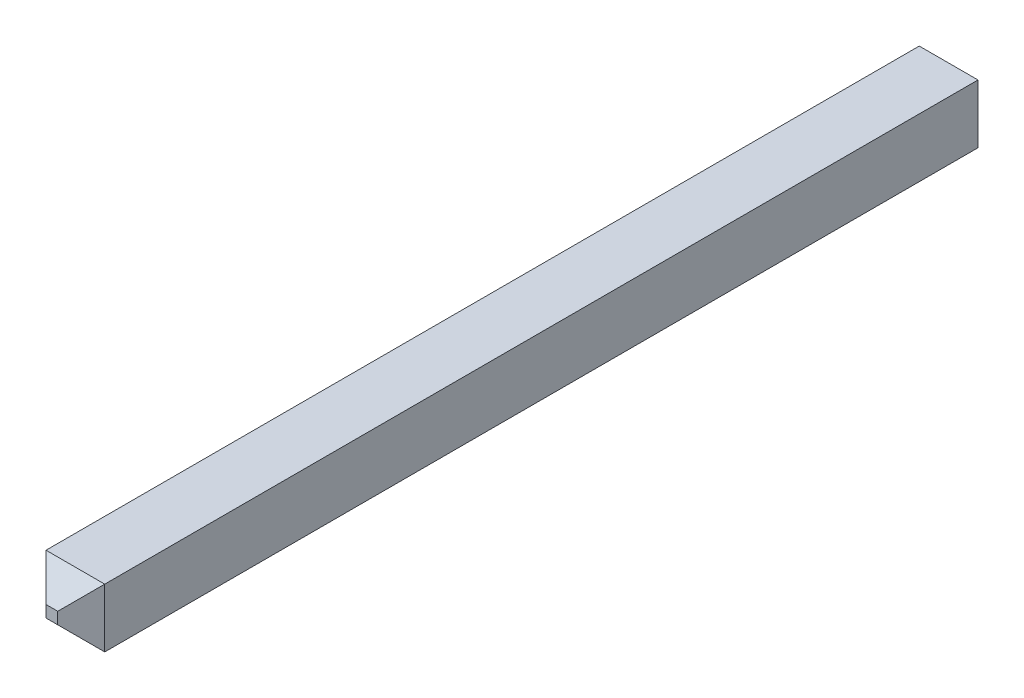
ISO-10303-21;
HEADER;
FILE_DESCRIPTION(('STEP AP214'),'2;1');
FILE_NAME('part.step','',(''),(''),'','','');
FILE_SCHEMA(('AUTOMOTIVE_DESIGN { 1 0 10303 214 1 1 1 1 }'));
ENDSEC;
DATA;
#1=APPLICATION_CONTEXT('core data for automotive mechanical design processes');
#2=APPLICATION_PROTOCOL_DEFINITION('international standard','automotive_design',2000,#1);
#3=PRODUCT_CONTEXT('',#1,'mechanical');
#4=PRODUCT('Part','Part','',(#3));
#5=PRODUCT_RELATED_PRODUCT_CATEGORY('part','',(#4));
#6=PRODUCT_DEFINITION_FORMATION('','',#4);
#7=PRODUCT_DEFINITION_CONTEXT('part definition',#1,'design');
#8=PRODUCT_DEFINITION('design','',#6,#7);
#9=PRODUCT_DEFINITION_SHAPE('','',#8);
#10=(LENGTH_UNIT() NAMED_UNIT(*) SI_UNIT(.MILLI.,.METRE.));
#11=(NAMED_UNIT(*) PLANE_ANGLE_UNIT() SI_UNIT($,.RADIAN.));
#12=(NAMED_UNIT(*) SI_UNIT($,.STERADIAN.) SOLID_ANGLE_UNIT());
#13=UNCERTAINTY_MEASURE_WITH_UNIT(LENGTH_MEASURE(1.E-05),#10,'distance_accuracy_value','');
#14=(GEOMETRIC_REPRESENTATION_CONTEXT(3) GLOBAL_UNCERTAINTY_ASSIGNED_CONTEXT((#13)) GLOBAL_UNIT_ASSIGNED_CONTEXT((#10,
#11,#12)) REPRESENTATION_CONTEXT('',''));
#15=CARTESIAN_POINT('',(0.,0.,0.));
#16=DIRECTION('',(0.,0.,1.));
#17=DIRECTION('',(1.,0.,0.));
#18=AXIS2_PLACEMENT_3D('',#15,#16,#17);
#19=CARTESIAN_POINT('',(1.39830129446248,-0.63246993855321,0.400212598425197));
#20=DIRECTION('',(0.,-0.707106781186544,-0.707106781186551));
#21=DIRECTION('',(0.,0.707106781186551,-0.707106781186544));
#22=AXIS2_PLACEMENT_3D('',#19,#20,#21);
#23=PLANE('',#22);
#24=DIRECTION('',(0.577350269189659,-0.577350269189564,0.577350269189654));
#25=VECTOR('',#24,1.);
#26=CARTESIAN_POINT('',(1.3672973574546,-0.62006836375006,0.387811023622047));
#27=LINE('',#26,#25);
#28=CARTESIAN_POINT('',(1.3672973574546,-0.62006836375006,0.387811023622047));
#29=VERTEX_POINT('',#28);
#30=CARTESIAN_POINT('',(1.37910838107665,-0.631879387372107,0.399622047244095));
#31=VERTEX_POINT('',#30);
#32=EDGE_CURVE('E105',#29,#31,#27,.T.);
#33=ORIENTED_EDGE('',*,*,#32,.T.);
#34=DIRECTION('',(1.,0.,0.));
#35=VECTOR('',#34,1.);
#36=CARTESIAN_POINT('',(1.38530916847823,-0.631879387372107,0.399622047244095));
#37=LINE('',#36,#35);
#38=CARTESIAN_POINT('',(1.38501389288767,-0.631879387372107,0.399622047244095));
#39=VERTEX_POINT('',#38);
#40=EDGE_CURVE('E79',#39,#31,#37,.F.);
#41=ORIENTED_EDGE('',*,*,#40,.F.);
#42=DIRECTION('',(-0.57735026918966,-0.577350269189565,0.577350269189652));
#43=VECTOR('',#42,1.);
#44=CARTESIAN_POINT('',(1.39682491650972,-0.62006836375006,0.387811023622047));
#45=LINE('',#44,#43);
#46=CARTESIAN_POINT('',(1.39682491650972,-0.62006836375006,0.387811023622047));
#47=VERTEX_POINT('',#46);
#48=EDGE_CURVE('E117',#47,#39,#45,.T.);
#49=ORIENTED_EDGE('',*,*,#48,.F.);
#50=DIRECTION('',(1.,0.,0.));
#51=VECTOR('',#50,1.);
#52=CARTESIAN_POINT('',(1.36582097950185,-0.62006836375006,0.387811023622047));
#53=LINE('',#52,#51);
#54=EDGE_CURVE('E114',#47,#29,#53,.F.);
#55=ORIENTED_EDGE('',*,*,#54,.T.);
#56=EDGE_LOOP('',(#33,#41,#49,#55));
#57=FACE_BOUND('',#56,.T.);
#58=ADVANCED_FACE('F17',(#57),#23,.F.);
#59=CARTESIAN_POINT('',(1.36582097950185,-0.619477812568958,-0.0505748031496063));
#60=DIRECTION('',(0.,0.707106781186552,-0.707106781186543));
#61=DIRECTION('',(0.,0.707106781186543,0.707106781186552));
#62=AXIS2_PLACEMENT_3D('',#59,#60,#61);
#63=PLANE('',#62);
#64=DIRECTION('',(1.,0.,0.));
#65=VECTOR('',#64,1.);
#66=CARTESIAN_POINT('',(1.36582097950185,-0.62006836375006,-0.0511653543307086));
#67=LINE('',#66,#65);
#68=CARTESIAN_POINT('',(1.3672973574546,-0.62006836375006,-0.0511653543307082));
#69=VERTEX_POINT('',#68);
#70=CARTESIAN_POINT('',(1.39682491650972,-0.62006836375006,-0.0511653543307084));
#71=VERTEX_POINT('',#70);
#72=EDGE_CURVE('E112',#69,#71,#67,.T.);
#73=ORIENTED_EDGE('',*,*,#72,.T.);
#74=DIRECTION('',(-0.577350269189648,-0.577350269189574,-0.577350269189655));
#75=VECTOR('',#74,1.);
#76=CARTESIAN_POINT('',(1.39682491650972,-0.62006836375006,-0.0511653543307075));
#77=LINE('',#76,#75);
#78=CARTESIAN_POINT('',(1.38501389288767,-0.631879387372107,-0.0629763779527559));
#79=VERTEX_POINT('',#78);
#80=EDGE_CURVE('E98',#71,#79,#77,.T.);
#81=ORIENTED_EDGE('',*,*,#80,.T.);
#82=DIRECTION('',(1.,0.,0.));
#83=VECTOR('',#82,1.);
#84=CARTESIAN_POINT('',(1.38530916847823,-0.631879387372107,-0.062976377952756));
#85=LINE('',#84,#83);
#86=CARTESIAN_POINT('',(1.37910838107665,-0.631879387372107,-0.062976377952756));
#87=VERTEX_POINT('',#86);
#88=EDGE_CURVE('E20',#79,#87,#85,.F.);
#89=ORIENTED_EDGE('',*,*,#88,.T.);
#90=DIRECTION('',(0.577350269189653,-0.577350269189568,-0.577350269189657));
#91=VECTOR('',#90,1.);
#92=CARTESIAN_POINT('',(1.3672973574546,-0.62006836375006,-0.0511653543307075));
#93=LINE('',#92,#91);
#94=EDGE_CURVE('E85',#69,#87,#93,.T.);
#95=ORIENTED_EDGE('',*,*,#94,.F.);
#96=EDGE_LOOP('',(#73,#81,#89,#95));
#97=FACE_BOUND('',#96,.T.);
#98=ADVANCED_FACE('F97',(#97),#63,.T.);
#99=CARTESIAN_POINT('',(1.38530916847823,-0.638080174773682,-0.062976377952756));
#100=DIRECTION('',(0.,0.,1.));
#101=DIRECTION('',(1.,0.,0.));
#102=AXIS2_PLACEMENT_3D('',#99,#100,#101);
#103=PLANE('',#102);
#104=DIRECTION('',(0.,1.,0.));
#105=VECTOR('',#104,1.);
#106=CARTESIAN_POINT('',(1.37910838107665,-0.651072300757934,-0.0629763779527564));
#107=LINE('',#106,#105);
#108=CARTESIAN_POINT('',(1.37910838107665,-0.637784899183131,-0.0629763779527562));
#109=VERTEX_POINT('',#108);
#110=EDGE_CURVE('E90',#87,#109,#107,.F.);
#111=ORIENTED_EDGE('',*,*,#110,.F.);
#112=ORIENTED_EDGE('',*,*,#88,.F.);
#113=DIRECTION('',(0.,1.,0.));
#114=VECTOR('',#113,1.);
#115=CARTESIAN_POINT('',(1.38501389288767,-0.651072300757934,-0.0629763779527562));
#116=LINE('',#115,#114);
#117=CARTESIAN_POINT('',(1.38501389288767,-0.637784899183131,-0.0629763779527561));
#118=VERTEX_POINT('',#117);
#119=EDGE_CURVE('E122',#79,#118,#116,.F.);
#120=ORIENTED_EDGE('',*,*,#119,.T.);
#121=DIRECTION('',(1.,0.,0.));
#122=VECTOR('',#121,1.);
#123=CARTESIAN_POINT('',(1.39830129446248,-0.637784899183131,-0.0629763779527563));
#124=LINE('',#123,#122);
#125=EDGE_CURVE('E104',#109,#118,#124,.T.);
#126=ORIENTED_EDGE('',*,*,#125,.F.);
#127=EDGE_LOOP('',(#111,#112,#120,#126));
#128=FACE_BOUND('',#127,.T.);
#129=ADVANCED_FACE('F103',(#128),#103,.F.);
#130=CARTESIAN_POINT('',(1.3667068062735,-0.651072300757934,-0.0505748031496063));
#131=DIRECTION('',(-0.707106781186552,0.,-0.707106781186543));
#132=DIRECTION('',(-0.707106781186543,0.,0.707106781186552));
#133=AXIS2_PLACEMENT_3D('',#130,#131,#132);
#134=PLANE('',#133);
#135=ORIENTED_EDGE('',*,*,#94,.T.);
#136=ORIENTED_EDGE('',*,*,#110,.T.);
#137=DIRECTION('',(0.577350269189705,0.577350269189583,-0.57735026918959));
#138=VECTOR('',#137,1.);
#139=CARTESIAN_POINT('',(1.3672973574546,-0.649595922805179,-0.0511653543307085));
#140=LINE('',#139,#138);
#141=CARTESIAN_POINT('',(1.3672973574546,-0.649595922805179,-0.051165354330708));
#142=VERTEX_POINT('',#141);
#143=EDGE_CURVE('E124',#142,#109,#140,.T.);
#144=ORIENTED_EDGE('',*,*,#143,.F.);
#145=DIRECTION('',(0.,1.,0.));
#146=VECTOR('',#145,1.);
#147=CARTESIAN_POINT('',(1.3672973574546,-0.651072300757934,-0.0511653543307086));
#148=LINE('',#147,#146);
#149=EDGE_CURVE('E92',#142,#69,#148,.T.);
#150=ORIENTED_EDGE('',*,*,#149,.T.);
#151=EDGE_LOOP('',(#135,#136,#144,#150));
#152=FACE_BOUND('',#151,.T.);
#153=ADVANCED_FACE('F87',(#152),#134,.T.);
#154=CARTESIAN_POINT('',(1.37969893225775,-0.618591985797305,0.400212598425197));
#155=DIRECTION('',(0.707106781186544,0.,-0.707106781186551));
#156=DIRECTION('',(-0.707106781186551,0.,-0.707106781186544));
#157=AXIS2_PLACEMENT_3D('',#154,#155,#156);
#158=PLANE('',#157);
#159=DIRECTION('',(0.,1.,0.));
#160=VECTOR('',#159,1.);
#161=CARTESIAN_POINT('',(1.37910838107665,-0.638080174773682,0.399622047244095));
#162=LINE('',#161,#160);
#163=CARTESIAN_POINT('',(1.37910838107665,-0.637784899183131,0.399622047244095));
#164=VERTEX_POINT('',#163);
#165=EDGE_CURVE('E110',#31,#164,#162,.F.);
#166=ORIENTED_EDGE('',*,*,#165,.F.);
#167=ORIENTED_EDGE('',*,*,#32,.F.);
#168=DIRECTION('',(0.,1.,0.));
#169=VECTOR('',#168,1.);
#170=CARTESIAN_POINT('',(1.3672973574546,-0.651072300757934,0.387811023622047));
#171=LINE('',#170,#169);
#172=CARTESIAN_POINT('',(1.3672973574546,-0.649595922805179,0.387811023622047));
#173=VERTEX_POINT('',#172);
#174=EDGE_CURVE('E133',#29,#173,#171,.F.);
#175=ORIENTED_EDGE('',*,*,#174,.T.);
#176=DIRECTION('',(0.577350269189695,0.577350269189595,0.577350269189587));
#177=VECTOR('',#176,1.);
#178=CARTESIAN_POINT('',(1.3672973574546,-0.649595922805179,0.387811023622047));
#179=LINE('',#178,#177);
#180=EDGE_CURVE('E138',#173,#164,#179,.T.);
#181=ORIENTED_EDGE('',*,*,#180,.T.);
#182=EDGE_LOOP('',(#166,#167,#175,#181));
#183=FACE_BOUND('',#182,.T.);
#184=ADVANCED_FACE('F205',(#183),#158,.F.);
#185=CARTESIAN_POINT('',(1.38530916847823,-0.638080174773682,0.399622047244095));
#186=DIRECTION('',(0.,0.,1.));
#187=DIRECTION('',(1.,0.,0.));
#188=AXIS2_PLACEMENT_3D('',#185,#186,#187);
#189=PLANE('',#188);
#190=DIRECTION('',(1.,0.,0.));
#191=VECTOR('',#190,1.);
#192=CARTESIAN_POINT('',(1.36582097950185,-0.637784899183131,0.399622047244095));
#193=LINE('',#192,#191);
#194=CARTESIAN_POINT('',(1.38501389288767,-0.637784899183131,0.399622047244096));
#195=VERTEX_POINT('',#194);
#196=EDGE_CURVE('E141',#164,#195,#193,.T.);
#197=ORIENTED_EDGE('',*,*,#196,.T.);
#198=DIRECTION('',(0.,1.,0.));
#199=VECTOR('',#198,1.);
#200=CARTESIAN_POINT('',(1.38501389288767,-0.618591985797305,0.399622047244096));
#201=LINE('',#200,#199);
#202=EDGE_CURVE('E119',#39,#195,#201,.F.);
#203=ORIENTED_EDGE('',*,*,#202,.F.);
#204=ORIENTED_EDGE('',*,*,#40,.T.);
#205=ORIENTED_EDGE('',*,*,#165,.T.);
#206=EDGE_LOOP('',(#197,#203,#204,#205));
#207=FACE_BOUND('',#206,.T.);
#208=ADVANCED_FACE('F201',(#207),#189,.T.);
#209=CARTESIAN_POINT('',(1.36582097950185,-0.62006836375006,0.152181102362205));
#210=DIRECTION('',(0.,-1.,0.));
#211=DIRECTION('',(1.,0.,0.));
#212=AXIS2_PLACEMENT_3D('',#209,#210,#211);
#213=PLANE('',#212);
#214=ORIENTED_EDGE('',*,*,#54,.F.);
#215=DIRECTION('',(0.,0.,1.));
#216=VECTOR('',#215,1.);
#217=CARTESIAN_POINT('',(1.39682491650972,-0.62006836375006,0.152181102362205));
#218=LINE('',#217,#216);
#219=EDGE_CURVE('E144',#71,#47,#218,.T.);
#220=ORIENTED_EDGE('',*,*,#219,.F.);
#221=ORIENTED_EDGE('',*,*,#72,.F.);
#222=DIRECTION('',(0.,0.,1.));
#223=VECTOR('',#222,1.);
#224=CARTESIAN_POINT('',(1.3672973574546,-0.62006836375006,0.152181102362205));
#225=LINE('',#224,#223);
#226=EDGE_CURVE('E130',#69,#29,#225,.T.);
#227=ORIENTED_EDGE('',*,*,#226,.T.);
#228=EDGE_LOOP('',(#214,#220,#221,#227));
#229=FACE_BOUND('',#228,.T.);
#230=ADVANCED_FACE('F197',(#229),#213,.F.);
#231=CARTESIAN_POINT('',(1.38442334170657,-0.618591985797305,0.400212598425197));
#232=DIRECTION('',(0.707106781186544,0.,0.707106781186551));
#233=DIRECTION('',(0.707106781186551,0.,-0.707106781186544));
#234=AXIS2_PLACEMENT_3D('',#231,#232,#233);
#235=PLANE('',#234);
#236=ORIENTED_EDGE('',*,*,#48,.T.);
#237=ORIENTED_EDGE('',*,*,#202,.T.);
#238=DIRECTION('',(0.577350269189688,-0.577350269189598,-0.57735026918959));
#239=VECTOR('',#238,1.);
#240=CARTESIAN_POINT('',(1.38501389288767,-0.637784899183131,0.399622047244095));
#241=LINE('',#240,#239);
#242=CARTESIAN_POINT('',(1.39682491650972,-0.649595922805179,0.387811023622047));
#243=VERTEX_POINT('',#242);
#244=EDGE_CURVE('E136',#195,#243,#241,.T.);
#245=ORIENTED_EDGE('',*,*,#244,.T.);
#246=DIRECTION('',(0.,1.,0.));
#247=VECTOR('',#246,1.);
#248=CARTESIAN_POINT('',(1.39682491650972,-0.651072300757934,0.387811023622047));
#249=LINE('',#248,#247);
#250=EDGE_CURVE('E34',#47,#243,#249,.F.);
#251=ORIENTED_EDGE('',*,*,#250,.F.);
#252=EDGE_LOOP('',(#236,#237,#245,#251));
#253=FACE_BOUND('',#252,.T.);
#254=ADVANCED_FACE('F194',(#253),#235,.T.);
#255=CARTESIAN_POINT('',(1.39741546769082,-0.651072300757934,-0.0505748031496063));
#256=DIRECTION('',(-0.707106781186552,0.,0.707106781186543));
#257=DIRECTION('',(0.707106781186543,0.,0.707106781186552));
#258=AXIS2_PLACEMENT_3D('',#255,#256,#257);
#259=PLANE('',#258);
#260=ORIENTED_EDGE('',*,*,#119,.F.);
#261=ORIENTED_EDGE('',*,*,#80,.F.);
#262=DIRECTION('',(0.,1.,0.));
#263=VECTOR('',#262,1.);
#264=CARTESIAN_POINT('',(1.39682491650972,-0.651072300757934,-0.0511653543307086));
#265=LINE('',#264,#263);
#266=CARTESIAN_POINT('',(1.39682491650972,-0.649595922805179,-0.051165354330708));
#267=VERTEX_POINT('',#266);
#268=EDGE_CURVE('E147',#267,#71,#265,.T.);
#269=ORIENTED_EDGE('',*,*,#268,.F.);
#270=DIRECTION('',(0.577350269189698,-0.577350269189586,0.577350269189593));
#271=VECTOR('',#270,1.);
#272=CARTESIAN_POINT('',(1.38501389288767,-0.637784899183131,-0.0629763779527563));
#273=LINE('',#272,#271);
#274=EDGE_CURVE('E127',#118,#267,#273,.T.);
#275=ORIENTED_EDGE('',*,*,#274,.F.);
#276=EDGE_LOOP('',(#260,#261,#269,#275));
#277=FACE_BOUND('',#276,.T.);
#278=ADVANCED_FACE('F175',(#277),#259,.F.);
#279=CARTESIAN_POINT('',(1.39830129446248,-0.650186473986281,-0.0505748031496063));
#280=DIRECTION('',(0.,-0.707106781186552,-0.707106781186543));
#281=DIRECTION('',(0.,0.707106781186543,-0.707106781186552));
#282=AXIS2_PLACEMENT_3D('',#279,#280,#281);
#283=PLANE('',#282);
#284=ORIENTED_EDGE('',*,*,#125,.T.);
#285=ORIENTED_EDGE('',*,*,#274,.T.);
#286=DIRECTION('',(-1.,0.,0.));
#287=VECTOR('',#286,1.);
#288=CARTESIAN_POINT('',(1.39830129446248,-0.649595922805179,-0.0511653543307086));
#289=LINE('',#288,#287);
#290=EDGE_CURVE('E150',#267,#142,#289,.T.);
#291=ORIENTED_EDGE('',*,*,#290,.T.);
#292=ORIENTED_EDGE('',*,*,#143,.T.);
#293=EDGE_LOOP('',(#284,#285,#291,#292));
#294=FACE_BOUND('',#293,.T.);
#295=ADVANCED_FACE('F171',(#294),#283,.T.);
#296=CARTESIAN_POINT('',(1.3672973574546,-0.651072300757934,0.152181102362205));
#297=DIRECTION('',(1.,0.,0.));
#298=DIRECTION('',(0.,1.,0.));
#299=AXIS2_PLACEMENT_3D('',#296,#297,#298);
#300=PLANE('',#299);
#301=ORIENTED_EDGE('',*,*,#174,.F.);
#302=ORIENTED_EDGE('',*,*,#226,.F.);
#303=ORIENTED_EDGE('',*,*,#149,.F.);
#304=DIRECTION('',(0.,0.,1.));
#305=VECTOR('',#304,1.);
#306=CARTESIAN_POINT('',(1.3672973574546,-0.649595922805179,0.152181102362205));
#307=LINE('',#306,#305);
#308=EDGE_CURVE('E153',#142,#173,#307,.T.);
#309=ORIENTED_EDGE('',*,*,#308,.T.);
#310=EDGE_LOOP('',(#301,#302,#303,#309));
#311=FACE_BOUND('',#310,.T.);
#312=ADVANCED_FACE('F169',(#311),#300,.F.);
#313=CARTESIAN_POINT('',(1.36582097950185,-0.637194348002029,0.400212598425197));
#314=DIRECTION('',(0.,0.707106781186544,-0.707106781186551));
#315=DIRECTION('',(0.,0.707106781186551,0.707106781186544));
#316=AXIS2_PLACEMENT_3D('',#313,#314,#315);
#317=PLANE('',#316);
#318=ORIENTED_EDGE('',*,*,#180,.F.);
#319=DIRECTION('',(-1.,0.,0.));
#320=VECTOR('',#319,1.);
#321=CARTESIAN_POINT('',(1.39830129446248,-0.649595922805179,0.387811023622047));
#322=LINE('',#321,#320);
#323=EDGE_CURVE('E26',#173,#243,#322,.F.);
#324=ORIENTED_EDGE('',*,*,#323,.T.);
#325=ORIENTED_EDGE('',*,*,#244,.F.);
#326=ORIENTED_EDGE('',*,*,#196,.F.);
#327=EDGE_LOOP('',(#318,#324,#325,#326));
#328=FACE_BOUND('',#327,.T.);
#329=ADVANCED_FACE('F160',(#328),#317,.F.);
#330=CARTESIAN_POINT('',(1.39682491650972,-0.651072300757934,0.152181102362205));
#331=DIRECTION('',(1.,0.,0.));
#332=DIRECTION('',(0.,1.,0.));
#333=AXIS2_PLACEMENT_3D('',#330,#331,#332);
#334=PLANE('',#333);
#335=DIRECTION('',(0.,0.,1.));
#336=VECTOR('',#335,1.);
#337=CARTESIAN_POINT('',(1.39682491650972,-0.649595922805179,0.152181102362205));
#338=LINE('',#337,#336);
#339=EDGE_CURVE('E11',#243,#267,#338,.F.);
#340=ORIENTED_EDGE('',*,*,#339,.T.);
#341=ORIENTED_EDGE('',*,*,#268,.T.);
#342=ORIENTED_EDGE('',*,*,#219,.T.);
#343=ORIENTED_EDGE('',*,*,#250,.T.);
#344=EDGE_LOOP('',(#340,#341,#342,#343));
#345=FACE_BOUND('',#344,.T.);
#346=ADVANCED_FACE('F177',(#345),#334,.T.);
#347=CARTESIAN_POINT('',(1.39830129446248,-0.649595922805179,0.152181102362205));
#348=DIRECTION('',(0.,1.,0.));
#349=DIRECTION('',(-1.,0.,0.));
#350=AXIS2_PLACEMENT_3D('',#347,#348,#349);
#351=PLANE('',#350);
#352=ORIENTED_EDGE('',*,*,#323,.F.);
#353=ORIENTED_EDGE('',*,*,#308,.F.);
#354=ORIENTED_EDGE('',*,*,#290,.F.);
#355=ORIENTED_EDGE('',*,*,#339,.F.);
#356=EDGE_LOOP('',(#352,#353,#354,#355));
#357=FACE_BOUND('',#356,.T.);
#358=ADVANCED_FACE('F165',(#357),#351,.F.);
#359=CLOSED_SHELL('',(#58,#98,#129,#153,#184,#208,#230,#254,#278,#295,#312,#329,#346,#358));
#360=MANIFOLD_SOLID_BREP('B1',#359);
#361=ADVANCED_BREP_SHAPE_REPRESENTATION('',(#18,#360),#14);
#362=SHAPE_DEFINITION_REPRESENTATION(#9,#361);
ENDSEC;
END-ISO-10303-21;
